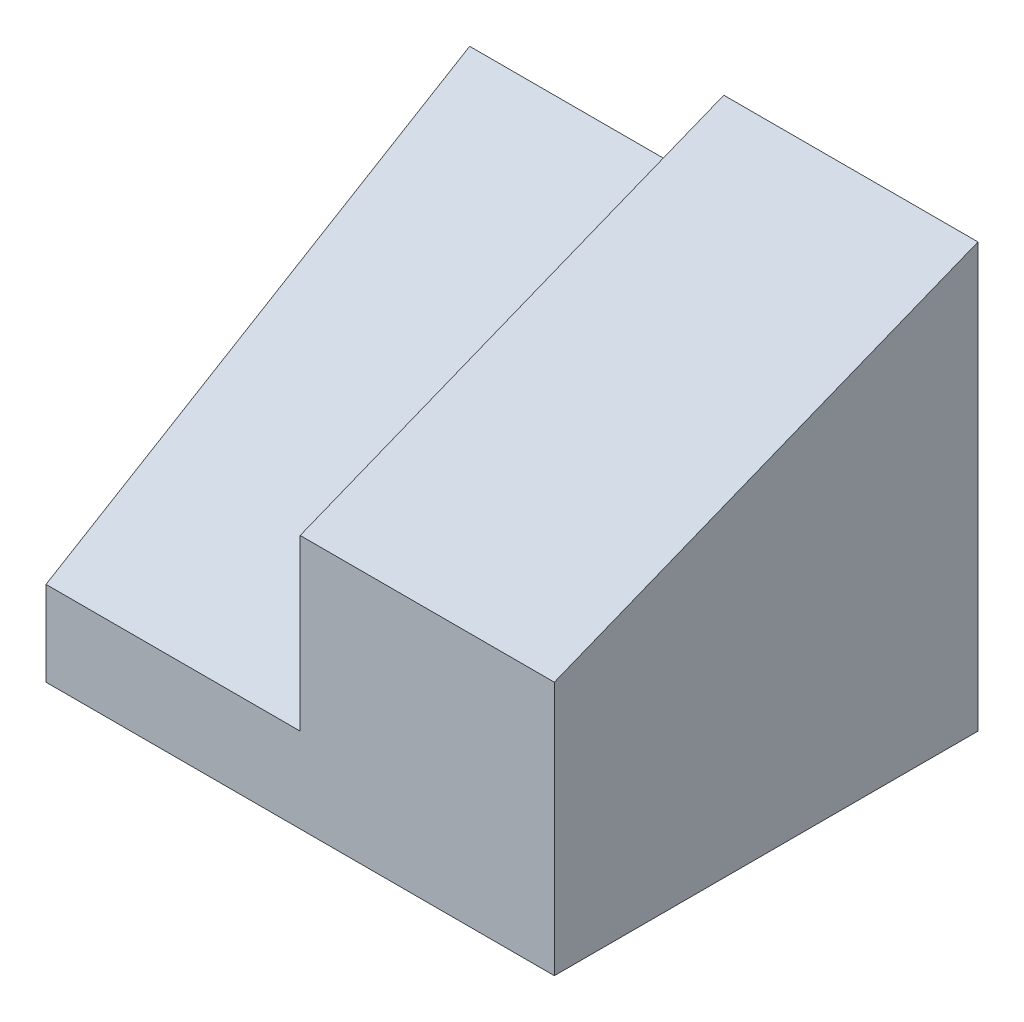
ISO-10303-21;
HEADER;
FILE_DESCRIPTION(('STEP AP214'),'2;1');
FILE_NAME('part.step','',(''),(''),'','','');
FILE_SCHEMA(('AUTOMOTIVE_DESIGN { 1 0 10303 214 1 1 1 1 }'));
ENDSEC;
DATA;
#1=APPLICATION_CONTEXT('core data for automotive mechanical design processes');
#2=APPLICATION_PROTOCOL_DEFINITION('international standard','automotive_design',2000,#1);
#3=PRODUCT_CONTEXT('',#1,'mechanical');
#4=PRODUCT('Part','Part','',(#3));
#5=PRODUCT_RELATED_PRODUCT_CATEGORY('part','',(#4));
#6=PRODUCT_DEFINITION_FORMATION('','',#4);
#7=PRODUCT_DEFINITION_CONTEXT('part definition',#1,'design');
#8=PRODUCT_DEFINITION('design','',#6,#7);
#9=PRODUCT_DEFINITION_SHAPE('','',#8);
#10=(LENGTH_UNIT() NAMED_UNIT(*) SI_UNIT(.MILLI.,.METRE.));
#11=(NAMED_UNIT(*) PLANE_ANGLE_UNIT() SI_UNIT($,.RADIAN.));
#12=(NAMED_UNIT(*) SI_UNIT($,.STERADIAN.) SOLID_ANGLE_UNIT());
#13=UNCERTAINTY_MEASURE_WITH_UNIT(LENGTH_MEASURE(1.E-05),#10,'distance_accuracy_value','');
#14=(GEOMETRIC_REPRESENTATION_CONTEXT(3) GLOBAL_UNCERTAINTY_ASSIGNED_CONTEXT((#13)) GLOBAL_UNIT_ASSIGNED_CONTEXT((#10,
#11,#12)) REPRESENTATION_CONTEXT('',''));
#15=CARTESIAN_POINT('',(0.,0.,0.));
#16=DIRECTION('',(0.,0.,1.));
#17=DIRECTION('',(1.,0.,0.));
#18=AXIS2_PLACEMENT_3D('',#15,#16,#17);
#19=CARTESIAN_POINT('',(-15.,5.,25.));
#20=DIRECTION('',(1.,0.,0.));
#21=DIRECTION('',(0.,0.,-1.));
#22=AXIS2_PLACEMENT_3D('',#19,#20,#21);
#23=PLANE('',#22);
#24=DIRECTION('',(0.,0.514495755427526,-0.857492925712544));
#25=VECTOR('',#24,1.);
#26=CARTESIAN_POINT('',(-15.,20.,0.));
#27=LINE('',#26,#25);
#28=CARTESIAN_POINT('',(-15.,5.,25.));
#29=VERTEX_POINT('',#28);
#30=CARTESIAN_POINT('',(-15.,20.,0.));
#31=VERTEX_POINT('',#30);
#32=EDGE_CURVE('E99',#29,#31,#27,.T.);
#33=ORIENTED_EDGE('',*,*,#32,.F.);
#34=DIRECTION('',(0.,-1.,0.));
#35=VECTOR('',#34,1.);
#36=CARTESIAN_POINT('',(-15.,5.,25.));
#37=LINE('',#36,#35);
#38=CARTESIAN_POINT('',(-15.,15.,25.));
#39=VERTEX_POINT('',#38);
#40=EDGE_CURVE('E90',#39,#29,#37,.T.);
#41=ORIENTED_EDGE('',*,*,#40,.F.);
#42=DIRECTION('',(0.,-0.371390676354104,0.928476690885259));
#43=VECTOR('',#42,1.);
#44=CARTESIAN_POINT('',(-15.,25.,0.));
#45=LINE('',#44,#43);
#46=CARTESIAN_POINT('',(-15.,25.,0.));
#47=VERTEX_POINT('',#46);
#48=EDGE_CURVE('E98',#47,#39,#45,.T.);
#49=ORIENTED_EDGE('',*,*,#48,.F.);
#50=DIRECTION('',(0.,-1.,0.));
#51=VECTOR('',#50,1.);
#52=CARTESIAN_POINT('',(-15.,5.,0.));
#53=LINE('',#52,#51);
#54=EDGE_CURVE('E48',#47,#31,#53,.T.);
#55=ORIENTED_EDGE('',*,*,#54,.T.);
#56=EDGE_LOOP('',(#33,#41,#49,#55));
#57=FACE_BOUND('',#56,.T.);
#58=ADVANCED_FACE('F33',(#57),#23,.F.);
#59=CARTESIAN_POINT('',(-30.,0.,25.));
#60=DIRECTION('',(1.,0.,0.));
#61=DIRECTION('',(0.,0.,-1.));
#62=AXIS2_PLACEMENT_3D('',#59,#60,#61);
#63=PLANE('',#62);
#64=DIRECTION('',(0.,-1.,0.));
#65=VECTOR('',#64,1.);
#66=CARTESIAN_POINT('',(-30.,0.,0.));
#67=LINE('',#66,#65);
#68=CARTESIAN_POINT('',(-30.,20.,0.));
#69=VERTEX_POINT('',#68);
#70=CARTESIAN_POINT('',(-30.,0.,0.));
#71=VERTEX_POINT('',#70);
#72=EDGE_CURVE('E107',#69,#71,#67,.T.);
#73=ORIENTED_EDGE('',*,*,#72,.T.);
#74=DIRECTION('',(0.,0.,-1.));
#75=VECTOR('',#74,1.);
#76=CARTESIAN_POINT('',(-30.,0.,25.));
#77=LINE('',#76,#75);
#78=CARTESIAN_POINT('',(-30.,0.,25.));
#79=VERTEX_POINT('',#78);
#80=EDGE_CURVE('E11',#79,#71,#77,.T.);
#81=ORIENTED_EDGE('',*,*,#80,.F.);
#82=DIRECTION('',(0.,-1.,0.));
#83=VECTOR('',#82,1.);
#84=CARTESIAN_POINT('',(-30.,0.,25.));
#85=LINE('',#84,#83);
#86=CARTESIAN_POINT('',(-30.,5.,25.));
#87=VERTEX_POINT('',#86);
#88=EDGE_CURVE('E114',#87,#79,#85,.T.);
#89=ORIENTED_EDGE('',*,*,#88,.F.);
#90=DIRECTION('',(0.,0.514495755427526,-0.857492925712544));
#91=VECTOR('',#90,1.);
#92=CARTESIAN_POINT('',(-30.,20.,0.));
#93=LINE('',#92,#91);
#94=EDGE_CURVE('E139',#87,#69,#93,.T.);
#95=ORIENTED_EDGE('',*,*,#94,.T.);
#96=EDGE_LOOP('',(#73,#81,#89,#95));
#97=FACE_BOUND('',#96,.T.);
#98=ADVANCED_FACE('F35',(#97),#63,.F.);
#99=CARTESIAN_POINT('',(0.,0.,25.));
#100=DIRECTION('',(0.,1.,0.));
#101=DIRECTION('',(-1.,0.,0.));
#102=AXIS2_PLACEMENT_3D('',#99,#100,#101);
#103=PLANE('',#102);
#104=DIRECTION('',(1.,0.,0.));
#105=VECTOR('',#104,1.);
#106=CARTESIAN_POINT('',(0.,0.,0.));
#107=LINE('',#106,#105);
#108=CARTESIAN_POINT('',(0.,0.,0.));
#109=VERTEX_POINT('',#108);
#110=EDGE_CURVE('E71',#71,#109,#107,.T.);
#111=ORIENTED_EDGE('',*,*,#110,.T.);
#112=DIRECTION('',(0.,0.,-1.));
#113=VECTOR('',#112,1.);
#114=CARTESIAN_POINT('',(0.,0.,25.));
#115=LINE('',#114,#113);
#116=CARTESIAN_POINT('',(0.,0.,25.));
#117=VERTEX_POINT('',#116);
#118=EDGE_CURVE('E41',#117,#109,#115,.T.);
#119=ORIENTED_EDGE('',*,*,#118,.F.);
#120=DIRECTION('',(1.,0.,0.));
#121=VECTOR('',#120,1.);
#122=CARTESIAN_POINT('',(0.,0.,25.));
#123=LINE('',#122,#121);
#124=EDGE_CURVE('E77',#79,#117,#123,.T.);
#125=ORIENTED_EDGE('',*,*,#124,.F.);
#126=ORIENTED_EDGE('',*,*,#80,.T.);
#127=EDGE_LOOP('',(#111,#119,#125,#126));
#128=FACE_BOUND('',#127,.T.);
#129=ADVANCED_FACE('F154',(#128),#103,.F.);
#130=CARTESIAN_POINT('',(0.,15.,25.));
#131=DIRECTION('',(-1.,0.,0.));
#132=DIRECTION('',(0.,0.,1.));
#133=AXIS2_PLACEMENT_3D('',#130,#131,#132);
#134=PLANE('',#133);
#135=DIRECTION('',(0.,1.,0.));
#136=VECTOR('',#135,1.);
#137=CARTESIAN_POINT('',(0.,15.,0.));
#138=LINE('',#137,#136);
#139=CARTESIAN_POINT('',(0.,25.,0.));
#140=VERTEX_POINT('',#139);
#141=EDGE_CURVE('E122',#109,#140,#138,.T.);
#142=ORIENTED_EDGE('',*,*,#141,.T.);
#143=DIRECTION('',(0.,-0.371390676354104,0.928476690885259));
#144=VECTOR('',#143,1.);
#145=CARTESIAN_POINT('',(0.,25.,0.));
#146=LINE('',#145,#144);
#147=CARTESIAN_POINT('',(0.,15.,25.));
#148=VERTEX_POINT('',#147);
#149=EDGE_CURVE('E105',#140,#148,#146,.T.);
#150=ORIENTED_EDGE('',*,*,#149,.T.);
#151=DIRECTION('',(0.,1.,0.));
#152=VECTOR('',#151,1.);
#153=CARTESIAN_POINT('',(0.,15.,25.));
#154=LINE('',#153,#152);
#155=EDGE_CURVE('E92',#117,#148,#154,.T.);
#156=ORIENTED_EDGE('',*,*,#155,.F.);
#157=ORIENTED_EDGE('',*,*,#118,.T.);
#158=EDGE_LOOP('',(#142,#150,#156,#157));
#159=FACE_BOUND('',#158,.T.);
#160=ADVANCED_FACE('F127',(#159),#134,.F.);
#161=CARTESIAN_POINT('',(0.,0.,25.));
#162=DIRECTION('',(0.,0.,-1.));
#163=DIRECTION('',(-1.,0.,0.));
#164=AXIS2_PLACEMENT_3D('',#161,#162,#163);
#165=PLANE('',#164);
#166=ORIENTED_EDGE('',*,*,#88,.T.);
#167=ORIENTED_EDGE('',*,*,#124,.T.);
#168=ORIENTED_EDGE('',*,*,#155,.T.);
#169=DIRECTION('',(-1.,0.,0.));
#170=VECTOR('',#169,1.);
#171=CARTESIAN_POINT('',(-15.,15.,25.));
#172=LINE('',#171,#170);
#173=EDGE_CURVE('E87',#148,#39,#172,.T.);
#174=ORIENTED_EDGE('',*,*,#173,.T.);
#175=ORIENTED_EDGE('',*,*,#40,.T.);
#176=DIRECTION('',(-1.,0.,0.));
#177=VECTOR('',#176,1.);
#178=CARTESIAN_POINT('',(-30.,5.,25.));
#179=LINE('',#178,#177);
#180=EDGE_CURVE('E57',#29,#87,#179,.T.);
#181=ORIENTED_EDGE('',*,*,#180,.T.);
#182=EDGE_LOOP('',(#166,#167,#168,#174,#175,#181));
#183=FACE_BOUND('',#182,.T.);
#184=ADVANCED_FACE('F89',(#183),#165,.F.);
#185=CARTESIAN_POINT('',(0.,0.,0.));
#186=DIRECTION('',(0.,0.,-1.));
#187=DIRECTION('',(-1.,0.,0.));
#188=AXIS2_PLACEMENT_3D('',#185,#186,#187);
#189=PLANE('',#188);
#190=ORIENTED_EDGE('',*,*,#72,.F.);
#191=DIRECTION('',(1.,0.,0.));
#192=VECTOR('',#191,1.);
#193=CARTESIAN_POINT('',(-30.,20.,0.));
#194=LINE('',#193,#192);
#195=EDGE_CURVE('E109',#69,#31,#194,.T.);
#196=ORIENTED_EDGE('',*,*,#195,.T.);
#197=ORIENTED_EDGE('',*,*,#54,.F.);
#198=DIRECTION('',(1.,0.,0.));
#199=VECTOR('',#198,1.);
#200=CARTESIAN_POINT('',(-15.,25.,0.));
#201=LINE('',#200,#199);
#202=EDGE_CURVE('E104',#47,#140,#201,.T.);
#203=ORIENTED_EDGE('',*,*,#202,.T.);
#204=ORIENTED_EDGE('',*,*,#141,.F.);
#205=ORIENTED_EDGE('',*,*,#110,.F.);
#206=EDGE_LOOP('',(#190,#196,#197,#203,#204,#205));
#207=FACE_BOUND('',#206,.T.);
#208=ADVANCED_FACE('F130',(#207),#189,.T.);
#209=CARTESIAN_POINT('',(-15.,25.,0.));
#210=DIRECTION('',(0.,0.928476690885259,0.371390676354104));
#211=DIRECTION('',(0.,-0.371390676354104,0.928476690885259));
#212=AXIS2_PLACEMENT_3D('',#209,#210,#211);
#213=PLANE('',#212);
#214=ORIENTED_EDGE('',*,*,#149,.F.);
#215=ORIENTED_EDGE('',*,*,#202,.F.);
#216=ORIENTED_EDGE('',*,*,#48,.T.);
#217=ORIENTED_EDGE('',*,*,#173,.F.);
#218=EDGE_LOOP('',(#214,#215,#216,#217));
#219=FACE_BOUND('',#218,.T.);
#220=ADVANCED_FACE('F102',(#219),#213,.T.);
#221=CARTESIAN_POINT('',(-30.,20.,0.));
#222=DIRECTION('',(0.,-0.857492925712544,-0.514495755427526));
#223=DIRECTION('',(0.,0.514495755427526,-0.857492925712544));
#224=AXIS2_PLACEMENT_3D('',#221,#222,#223);
#225=PLANE('',#224);
#226=ORIENTED_EDGE('',*,*,#32,.T.);
#227=ORIENTED_EDGE('',*,*,#195,.F.);
#228=ORIENTED_EDGE('',*,*,#94,.F.);
#229=ORIENTED_EDGE('',*,*,#180,.F.);
#230=EDGE_LOOP('',(#226,#227,#228,#229));
#231=FACE_BOUND('',#230,.T.);
#232=ADVANCED_FACE('F142',(#231),#225,.F.);
#233=CLOSED_SHELL('',(#58,#98,#129,#160,#184,#208,#220,#232));
#234=MANIFOLD_SOLID_BREP('B2',#233);
#235=ADVANCED_BREP_SHAPE_REPRESENTATION('',(#18,#234),#14);
#236=SHAPE_DEFINITION_REPRESENTATION(#9,#235);
ENDSEC;
END-ISO-10303-21;
